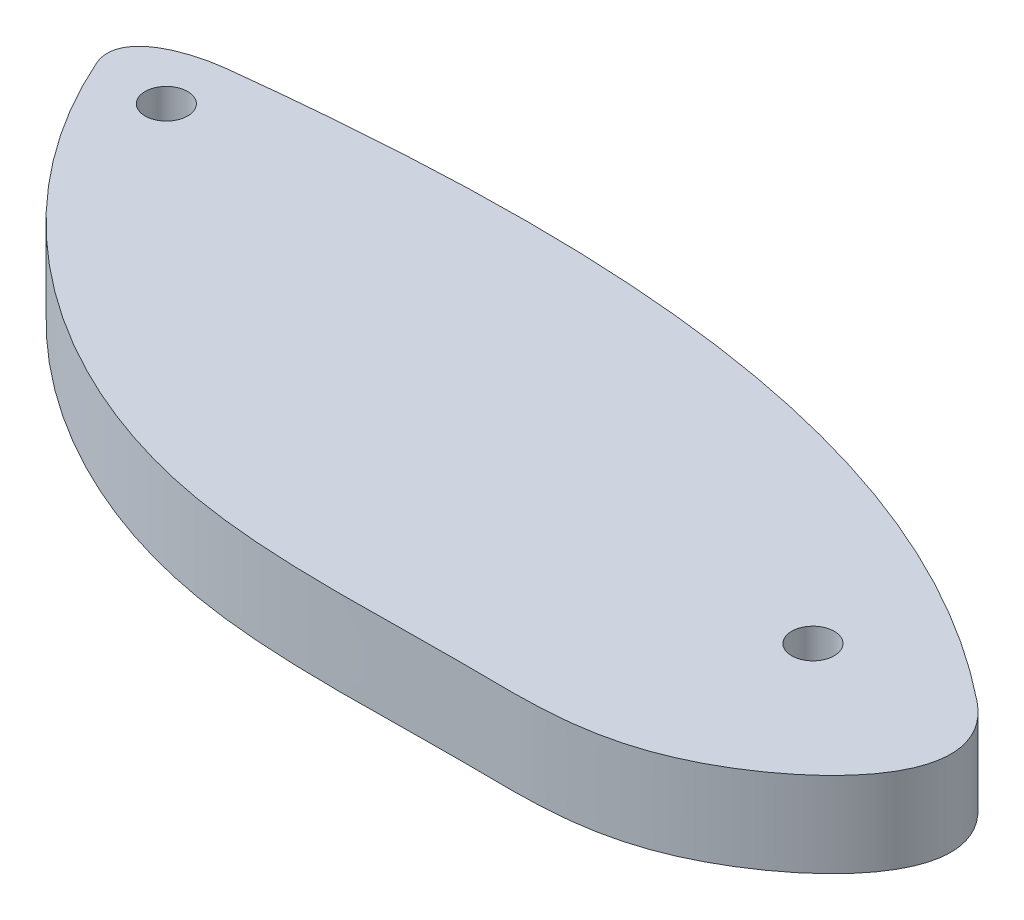
ISO-10303-21;
HEADER;
FILE_DESCRIPTION(('STEP AP214'),'2;1');
FILE_NAME('part.step','',(''),(''),'','','');
FILE_SCHEMA(('AUTOMOTIVE_DESIGN { 1 0 10303 214 1 1 1 1 }'));
ENDSEC;
DATA;
#1=APPLICATION_CONTEXT('core data for automotive mechanical design processes');
#2=APPLICATION_PROTOCOL_DEFINITION('international standard','automotive_design',2000,#1);
#3=PRODUCT_CONTEXT('',#1,'mechanical');
#4=PRODUCT('Part','Part','',(#3));
#5=PRODUCT_RELATED_PRODUCT_CATEGORY('part','',(#4));
#6=PRODUCT_DEFINITION_FORMATION('','',#4);
#7=PRODUCT_DEFINITION_CONTEXT('part definition',#1,'design');
#8=PRODUCT_DEFINITION('design','',#6,#7);
#9=PRODUCT_DEFINITION_SHAPE('','',#8);
#10=(LENGTH_UNIT() NAMED_UNIT(*) SI_UNIT(.MILLI.,.METRE.));
#11=(NAMED_UNIT(*) PLANE_ANGLE_UNIT() SI_UNIT($,.RADIAN.));
#12=(NAMED_UNIT(*) SI_UNIT($,.STERADIAN.) SOLID_ANGLE_UNIT());
#13=UNCERTAINTY_MEASURE_WITH_UNIT(LENGTH_MEASURE(1.E-05),#10,'distance_accuracy_value','');
#14=(GEOMETRIC_REPRESENTATION_CONTEXT(3) GLOBAL_UNCERTAINTY_ASSIGNED_CONTEXT((#13)) GLOBAL_UNIT_ASSIGNED_CONTEXT((#10,
#11,#12)) REPRESENTATION_CONTEXT('',''));
#15=CARTESIAN_POINT('',(0.,0.,0.));
#16=DIRECTION('',(0.,0.,1.));
#17=DIRECTION('',(1.,0.,0.));
#18=AXIS2_PLACEMENT_3D('',#15,#16,#17);
#19=CARTESIAN_POINT('',(49.9544900615387,3.175,-16.0320705516007));
#20=DIRECTION('',(0.,1.,0.));
#21=DIRECTION('',(0.,0.,1.));
#22=AXIS2_PLACEMENT_3D('',#19,#20,#21);
#23=PLANE('',#22);
#24=CARTESIAN_POINT('',(52.0232420948971,3.175,-14.4431575445156));
#25=DIRECTION('',(0.,1.,0.));
#26=DIRECTION('',(0.,0.,1.));
#27=AXIS2_PLACEMENT_3D('',#24,#25,#26);
#28=CIRCLE('',#27,0.79375);
#29=CARTESIAN_POINT('',(52.0232420948971,3.175,-13.6494075445156));
#30=VERTEX_POINT('',#29);
#31=EDGE_CURVE('E84',#30,#30,#28,.T.);
#32=ORIENTED_EDGE('',*,*,#31,.F.);
#33=EDGE_LOOP('',(#32));
#34=FACE_BOUND('',#33,.T.);
#35=CARTESIAN_POINT('',(52.0232420948971,3.175,-16.7037856988239));
#36=CARTESIAN_POINT('',(50.6006156334276,3.175,-16.5419067906307));
#37=CARTESIAN_POINT('',(48.7995473378633,3.175,-15.8279669325247));
#38=CARTESIAN_POINT('',(49.4121894835404,3.175,-14.4431575445156));
#39=B_SPLINE_CURVE_WITH_KNOTS('',3,(#35,#36,#37,#38),.UNSPECIFIED.,.F.,.F.,(4,4),(0.,1.),.UNSPECIFIED.);
#40=CARTESIAN_POINT('',(52.0232420948971,3.175,-16.7037856988239));
#41=VERTEX_POINT('',#40);
#42=CARTESIAN_POINT('',(49.4121894835404,3.175,-14.4431575445156));
#43=VERTEX_POINT('',#42);
#44=EDGE_CURVE('E75',#41,#43,#39,.T.);
#45=ORIENTED_EDGE('',*,*,#44,.T.);
#46=CARTESIAN_POINT('',(49.4121894835404,3.175,-14.4431575445156));
#47=CARTESIAN_POINT('',(50.7616486958753,3.175,-11.3928551793209));
#48=CARTESIAN_POINT('',(55.1729870660218,3.175,-5.9151577548155));
#49=CARTESIAN_POINT('',(64.9786416197724,3.175,-1.39897882876347));
#50=CARTESIAN_POINT('',(75.1471853120607,3.175,-2.08973341457656));
#51=CARTESIAN_POINT('',(83.1058413049066,3.175,-1.55391046034072));
#52=CARTESIAN_POINT('',(89.4164106214962,3.175,-7.88859066938723));
#53=CARTESIAN_POINT('',(86.4630663321666,3.175,-10.2565596630155));
#54=B_SPLINE_CURVE_WITH_KNOTS('',3,(#46,#47,#48,#49,#50,#51,#52,#53),.UNSPECIFIED.,.F.,.F.,(4,1,
1,1,1,4),(0.,0.211071899186968,0.438109061435945,0.667266742613915,0.840751230209531,1.),.UNSPECIFIED.);
#55=CARTESIAN_POINT('',(86.4630663321666,3.175,-10.2565596630155));
#56=VERTEX_POINT('',#55);
#57=EDGE_CURVE('E71',#43,#56,#54,.T.);
#58=ORIENTED_EDGE('',*,*,#57,.T.);
#59=CARTESIAN_POINT('',(86.4630663321666,3.175,-10.2565596630155));
#60=CARTESIAN_POINT('',(83.2129865268934,3.175,-12.8624489369178));
#61=CARTESIAN_POINT('',(73.8987821228549,3.175,-17.3296170926746));
#62=CARTESIAN_POINT('',(61.5773303107866,3.175,-17.6559005126478));
#63=CARTESIAN_POINT('',(53.6454089590082,3.175,-16.8883700630134));
#64=CARTESIAN_POINT('',(52.0232420948971,3.175,-16.7037856988239));
#65=B_SPLINE_CURVE_WITH_KNOTS('',3,(#59,#60,#61,#62,#63,#64),.UNSPECIFIED.,.F.,.F.,(4,1,1,4),
(0.,0.3344815530331,0.861935931311443,1.),.UNSPECIFIED.);
#66=EDGE_CURVE('E51',#56,#41,#65,.T.);
#67=ORIENTED_EDGE('',*,*,#66,.T.);
#68=EDGE_LOOP('',(#45,#58,#67));
#69=FACE_BOUND('',#68,.T.);
#70=CARTESIAN_POINT('',(81.5332327459402,3.175,-9.06295373209787));
#71=DIRECTION('',(0.,1.,0.));
#72=DIRECTION('',(0.,0.,1.));
#73=AXIS2_PLACEMENT_3D('',#70,#71,#72);
#74=CIRCLE('',#73,0.793749999999993);
#75=CARTESIAN_POINT('',(81.5332327459402,3.175,-8.26920373209787));
#76=VERTEX_POINT('',#75);
#77=EDGE_CURVE('E123',#76,#76,#74,.T.);
#78=ORIENTED_EDGE('',*,*,#77,.F.);
#79=EDGE_LOOP('',(#78));
#80=FACE_BOUND('',#79,.T.);
#81=ADVANCED_FACE('F33',(#34,#69,#80),#23,.T.);
#82=CARTESIAN_POINT('',(49.9544900615387,0.,-16.0320705516007));
#83=DIRECTION('',(0.,1.,0.));
#84=DIRECTION('',(0.,0.,1.));
#85=AXIS2_PLACEMENT_3D('',#82,#83,#84);
#86=PLANE('',#85);
#87=CARTESIAN_POINT('',(52.0232420948971,0.,-16.7037856988239));
#88=CARTESIAN_POINT('',(50.6006156334276,0.,-16.5419067906307));
#89=CARTESIAN_POINT('',(48.7995473378633,0.,-15.8279669325247));
#90=CARTESIAN_POINT('',(49.4121894835404,0.,-14.4431575445156));
#91=B_SPLINE_CURVE_WITH_KNOTS('',3,(#87,#88,#89,#90),.UNSPECIFIED.,.F.,.F.,(4,4),(0.,1.),.UNSPECIFIED.);
#92=CARTESIAN_POINT('',(52.0232420948971,0.,-16.7037856988239));
#93=VERTEX_POINT('',#92);
#94=CARTESIAN_POINT('',(49.4121894835404,0.,-14.4431575445156));
#95=VERTEX_POINT('',#94);
#96=EDGE_CURVE('E81',#93,#95,#91,.T.);
#97=ORIENTED_EDGE('',*,*,#96,.F.);
#98=CARTESIAN_POINT('',(86.4630663321666,0.,-10.2565596630155));
#99=CARTESIAN_POINT('',(83.2129865268934,0.,-12.8624489369178));
#100=CARTESIAN_POINT('',(73.8987821228549,0.,-17.3296170926746));
#101=CARTESIAN_POINT('',(61.5773303107866,0.,-17.6559005126478));
#102=CARTESIAN_POINT('',(53.6454089590082,0.,-16.8883700630134));
#103=CARTESIAN_POINT('',(52.0232420948971,0.,-16.7037856988239));
#104=B_SPLINE_CURVE_WITH_KNOTS('',3,(#98,#99,#100,#101,#102,#103),.UNSPECIFIED.,.F.,.F.,(4,1,1,
4),(0.,0.3344815530331,0.861935931311443,1.),.UNSPECIFIED.);
#105=CARTESIAN_POINT('',(86.4630663321666,0.,-10.2565596630155));
#106=VERTEX_POINT('',#105);
#107=EDGE_CURVE('E68',#106,#93,#104,.T.);
#108=ORIENTED_EDGE('',*,*,#107,.F.);
#109=CARTESIAN_POINT('',(49.4121894835404,0.,-14.4431575445156));
#110=CARTESIAN_POINT('',(50.7616486958753,0.,-11.3928551793209));
#111=CARTESIAN_POINT('',(55.1729870660218,0.,-5.9151577548155));
#112=CARTESIAN_POINT('',(64.9786416197724,0.,-1.39897882876347));
#113=CARTESIAN_POINT('',(75.1471853120607,0.,-2.08973341457656));
#114=CARTESIAN_POINT('',(83.1058413049066,0.,-1.55391046034072));
#115=CARTESIAN_POINT('',(89.4164106214962,0.,-7.88859066938723));
#116=CARTESIAN_POINT('',(86.4630663321666,0.,-10.2565596630155));
#117=B_SPLINE_CURVE_WITH_KNOTS('',3,(#109,#110,#111,#112,#113,#114,#115,#116),.UNSPECIFIED.,.F.,
.F.,(4,1,1,1,1,4),(0.,0.211071899186968,0.438109061435945,0.667266742613915,0.840751230209531,
1.),.UNSPECIFIED.);
#118=EDGE_CURVE('E63',#95,#106,#117,.T.);
#119=ORIENTED_EDGE('',*,*,#118,.F.);
#120=EDGE_LOOP('',(#97,#108,#119));
#121=FACE_BOUND('',#120,.T.);
#122=CARTESIAN_POINT('',(52.0232420948971,0.,-14.4431575445156));
#123=DIRECTION('',(0.,1.,0.));
#124=DIRECTION('',(0.,0.,1.));
#125=AXIS2_PLACEMENT_3D('',#122,#123,#124);
#126=CIRCLE('',#125,0.79375);
#127=CARTESIAN_POINT('',(52.0232420948971,0.,-13.6494075445156));
#128=VERTEX_POINT('',#127);
#129=EDGE_CURVE('E88',#128,#128,#126,.T.);
#130=ORIENTED_EDGE('',*,*,#129,.T.);
#131=EDGE_LOOP('',(#130));
#132=FACE_BOUND('',#131,.T.);
#133=CARTESIAN_POINT('',(81.5332327459402,0.,-9.06295373209787));
#134=DIRECTION('',(0.,1.,0.));
#135=DIRECTION('',(0.,0.,1.));
#136=AXIS2_PLACEMENT_3D('',#133,#134,#135);
#137=CIRCLE('',#136,0.793749999999993);
#138=CARTESIAN_POINT('',(81.5332327459402,0.,-8.26920373209787));
#139=VERTEX_POINT('',#138);
#140=EDGE_CURVE('E121',#139,#139,#137,.T.);
#141=ORIENTED_EDGE('',*,*,#140,.T.);
#142=EDGE_LOOP('',(#141));
#143=FACE_BOUND('',#142,.T.);
#144=ADVANCED_FACE('F112',(#121,#132,#143),#86,.F.);
#145=DIRECTION('',(0.,-1.,0.));
#146=VECTOR('',#145,1.);
#147=SURFACE_OF_LINEAR_EXTRUSION('',#39,#146);
#148=ORIENTED_EDGE('',*,*,#96,.T.);
#149=DIRECTION('',(0.,-1.,0.));
#150=VECTOR('',#149,1.);
#151=CARTESIAN_POINT('',(49.4121894835404,3.175,-14.4431575445156));
#152=LINE('',#151,#150);
#153=EDGE_CURVE('E11',#43,#95,#152,.T.);
#154=ORIENTED_EDGE('',*,*,#153,.F.);
#155=ORIENTED_EDGE('',*,*,#44,.F.);
#156=DIRECTION('',(0.,-1.,0.));
#157=VECTOR('',#156,1.);
#158=CARTESIAN_POINT('',(52.0232420948971,3.175,-16.7037856988239));
#159=LINE('',#158,#157);
#160=EDGE_CURVE('E82',#41,#93,#159,.T.);
#161=ORIENTED_EDGE('',*,*,#160,.T.);
#162=EDGE_LOOP('',(#148,#154,#155,#161));
#163=FACE_BOUND('',#162,.T.);
#164=ADVANCED_FACE('F35',(#163),#147,.F.);
#165=DIRECTION('',(0.,-1.,0.));
#166=VECTOR('',#165,1.);
#167=SURFACE_OF_LINEAR_EXTRUSION('',#54,#166);
#168=ORIENTED_EDGE('',*,*,#118,.T.);
#169=DIRECTION('',(0.,-1.,0.));
#170=VECTOR('',#169,1.);
#171=CARTESIAN_POINT('',(86.4630663321666,3.175,-10.2565596630155));
#172=LINE('',#171,#170);
#173=EDGE_CURVE('E43',#56,#106,#172,.T.);
#174=ORIENTED_EDGE('',*,*,#173,.F.);
#175=ORIENTED_EDGE('',*,*,#57,.F.);
#176=ORIENTED_EDGE('',*,*,#153,.T.);
#177=EDGE_LOOP('',(#168,#174,#175,#176));
#178=FACE_BOUND('',#177,.T.);
#179=ADVANCED_FACE('F72',(#178),#167,.F.);
#180=DIRECTION('',(0.,-1.,0.));
#181=VECTOR('',#180,1.);
#182=SURFACE_OF_LINEAR_EXTRUSION('',#65,#181);
#183=ORIENTED_EDGE('',*,*,#107,.T.);
#184=ORIENTED_EDGE('',*,*,#160,.F.);
#185=ORIENTED_EDGE('',*,*,#66,.F.);
#186=ORIENTED_EDGE('',*,*,#173,.T.);
#187=EDGE_LOOP('',(#183,#184,#185,#186));
#188=FACE_BOUND('',#187,.T.);
#189=ADVANCED_FACE('F111',(#188),#182,.F.);
#190=CARTESIAN_POINT('',(52.0232420948971,3.175,-14.4431575445156));
#191=DIRECTION('',(0.,-1.,0.));
#192=DIRECTION('',(0.,0.,-1.));
#193=AXIS2_PLACEMENT_3D('',#190,#191,#192);
#194=CYLINDRICAL_SURFACE('',#193,0.79375);
#195=ORIENTED_EDGE('',*,*,#31,.T.);
#196=EDGE_LOOP('',(#195));
#197=FACE_BOUND('',#196,.T.);
#198=ORIENTED_EDGE('',*,*,#129,.F.);
#199=EDGE_LOOP('',(#198));
#200=FACE_BOUND('',#199,.T.);
#201=ADVANCED_FACE('F143',(#197,#200),#194,.F.);
#202=CARTESIAN_POINT('',(81.5332327459402,3.175,-9.06295373209787));
#203=DIRECTION('',(0.,-1.,0.));
#204=DIRECTION('',(0.,0.,-1.));
#205=AXIS2_PLACEMENT_3D('',#202,#203,#204);
#206=CYLINDRICAL_SURFACE('',#205,0.793749999999993);
#207=ORIENTED_EDGE('',*,*,#77,.T.);
#208=EDGE_LOOP('',(#207));
#209=FACE_BOUND('',#208,.T.);
#210=ORIENTED_EDGE('',*,*,#140,.F.);
#211=EDGE_LOOP('',(#210));
#212=FACE_BOUND('',#211,.T.);
#213=ADVANCED_FACE('F150',(#209,#212),#206,.F.);
#214=CLOSED_SHELL('',(#81,#144,#164,#179,#189,#201,#213));
#215=MANIFOLD_SOLID_BREP('B2',#214);
#216=ADVANCED_BREP_SHAPE_REPRESENTATION('',(#18,#215),#14);
#217=SHAPE_DEFINITION_REPRESENTATION(#9,#216);
ENDSEC;
END-ISO-10303-21;
